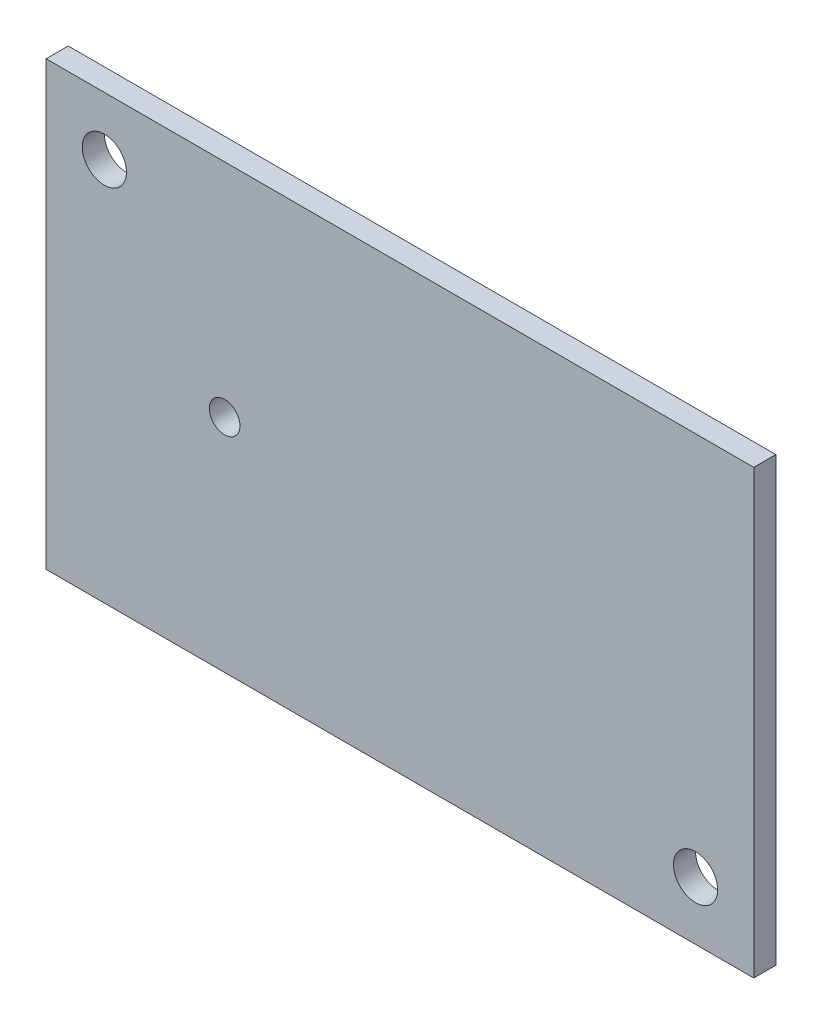
ISO-10303-21;
HEADER;
FILE_DESCRIPTION(('STEP AP214'),'2;1');
FILE_NAME('part.step','',(''),(''),'','','');
FILE_SCHEMA(('AUTOMOTIVE_DESIGN { 1 0 10303 214 1 1 1 1 }'));
ENDSEC;
DATA;
#1=APPLICATION_CONTEXT('core data for automotive mechanical design processes');
#2=APPLICATION_PROTOCOL_DEFINITION('international standard','automotive_design',2000,#1);
#3=PRODUCT_CONTEXT('',#1,'mechanical');
#4=PRODUCT('Part','Part','',(#3));
#5=PRODUCT_RELATED_PRODUCT_CATEGORY('part','',(#4));
#6=PRODUCT_DEFINITION_FORMATION('','',#4);
#7=PRODUCT_DEFINITION_CONTEXT('part definition',#1,'design');
#8=PRODUCT_DEFINITION('design','',#6,#7);
#9=PRODUCT_DEFINITION_SHAPE('','',#8);
#10=(LENGTH_UNIT() NAMED_UNIT(*) SI_UNIT(.MILLI.,.METRE.));
#11=(NAMED_UNIT(*) PLANE_ANGLE_UNIT() SI_UNIT($,.RADIAN.));
#12=(NAMED_UNIT(*) SI_UNIT($,.STERADIAN.) SOLID_ANGLE_UNIT());
#13=UNCERTAINTY_MEASURE_WITH_UNIT(LENGTH_MEASURE(1.E-05),#10,'distance_accuracy_value','');
#14=(GEOMETRIC_REPRESENTATION_CONTEXT(3) GLOBAL_UNCERTAINTY_ASSIGNED_CONTEXT((#13)) GLOBAL_UNIT_ASSIGNED_CONTEXT((#10,
#11,#12)) REPRESENTATION_CONTEXT('',''));
#15=CARTESIAN_POINT('',(0.,0.,0.));
#16=DIRECTION('',(0.,0.,1.));
#17=DIRECTION('',(1.,0.,0.));
#18=AXIS2_PLACEMENT_3D('',#15,#16,#17);
#19=CARTESIAN_POINT('',(-86.1290909090909,32.3272727272727,3.175));
#20=DIRECTION('',(1.,0.,0.));
#21=DIRECTION('',(0.,0.,-1.));
#22=AXIS2_PLACEMENT_3D('',#19,#20,#21);
#23=PLANE('',#22);
#24=DIRECTION('',(0.,-1.,0.));
#25=VECTOR('',#24,1.);
#26=CARTESIAN_POINT('',(-86.1290909090909,32.3272727272727,0.));
#27=LINE('',#26,#25);
#28=CARTESIAN_POINT('',(-86.1290909090909,32.3272727272727,0.));
#29=VERTEX_POINT('',#28);
#30=CARTESIAN_POINT('',(-86.1290909090909,-31.1727272727273,0.));
#31=VERTEX_POINT('',#30);
#32=EDGE_CURVE('E95',#29,#31,#27,.T.);
#33=ORIENTED_EDGE('',*,*,#32,.T.);
#34=DIRECTION('',(0.,0.,-1.));
#35=VECTOR('',#34,1.);
#36=CARTESIAN_POINT('',(-86.1290909090909,-31.1727272727273,3.175));
#37=LINE('',#36,#35);
#38=CARTESIAN_POINT('',(-86.1290909090909,-31.1727272727273,3.175));
#39=VERTEX_POINT('',#38);
#40=EDGE_CURVE('E11',#39,#31,#37,.T.);
#41=ORIENTED_EDGE('',*,*,#40,.F.);
#42=DIRECTION('',(0.,-1.,0.));
#43=VECTOR('',#42,1.);
#44=CARTESIAN_POINT('',(-86.1290909090909,32.3272727272727,3.175));
#45=LINE('',#44,#43);
#46=CARTESIAN_POINT('',(-86.1290909090909,32.3272727272727,3.175));
#47=VERTEX_POINT('',#46);
#48=EDGE_CURVE('E83',#47,#39,#45,.T.);
#49=ORIENTED_EDGE('',*,*,#48,.F.);
#50=DIRECTION('',(0.,0.,-1.));
#51=VECTOR('',#50,1.);
#52=CARTESIAN_POINT('',(-86.1290909090909,32.3272727272727,3.175));
#53=LINE('',#52,#51);
#54=EDGE_CURVE('E91',#47,#29,#53,.T.);
#55=ORIENTED_EDGE('',*,*,#54,.T.);
#56=EDGE_LOOP('',(#33,#41,#49,#55));
#57=FACE_BOUND('',#56,.T.);
#58=ADVANCED_FACE('F32',(#57),#23,.F.);
#59=CARTESIAN_POINT('',(-86.1290909090909,-31.1727272727273,3.175));
#60=DIRECTION('',(0.,1.,0.));
#61=DIRECTION('',(0.,0.,1.));
#62=AXIS2_PLACEMENT_3D('',#59,#60,#61);
#63=PLANE('',#62);
#64=DIRECTION('',(1.,0.,0.));
#65=VECTOR('',#64,1.);
#66=CARTESIAN_POINT('',(-86.1290909090909,-31.1727272727273,0.));
#67=LINE('',#66,#65);
#68=CARTESIAN_POINT('',(15.4709090909091,-31.1727272727273,0.));
#69=VERTEX_POINT('',#68);
#70=EDGE_CURVE('E87',#31,#69,#67,.T.);
#71=ORIENTED_EDGE('',*,*,#70,.T.);
#72=DIRECTION('',(0.,0.,-1.));
#73=VECTOR('',#72,1.);
#74=CARTESIAN_POINT('',(15.4709090909091,-31.1727272727273,3.175));
#75=LINE('',#74,#73);
#76=CARTESIAN_POINT('',(15.4709090909091,-31.1727272727273,3.175));
#77=VERTEX_POINT('',#76);
#78=EDGE_CURVE('E40',#77,#69,#75,.T.);
#79=ORIENTED_EDGE('',*,*,#78,.F.);
#80=DIRECTION('',(1.,0.,0.));
#81=VECTOR('',#80,1.);
#82=CARTESIAN_POINT('',(-86.1290909090909,-31.1727272727273,3.175));
#83=LINE('',#82,#81);
#84=EDGE_CURVE('E78',#39,#77,#83,.T.);
#85=ORIENTED_EDGE('',*,*,#84,.F.);
#86=ORIENTED_EDGE('',*,*,#40,.T.);
#87=EDGE_LOOP('',(#71,#79,#85,#86));
#88=FACE_BOUND('',#87,.T.);
#89=ADVANCED_FACE('F86',(#88),#63,.F.);
#90=CARTESIAN_POINT('',(15.4709090909091,32.3272727272727,3.175));
#91=DIRECTION('',(-1.,0.,0.));
#92=DIRECTION('',(0.,-1.,0.));
#93=AXIS2_PLACEMENT_3D('',#90,#91,#92);
#94=PLANE('',#93);
#95=DIRECTION('',(0.,1.,0.));
#96=VECTOR('',#95,1.);
#97=CARTESIAN_POINT('',(15.4709090909091,32.3272727272727,0.));
#98=LINE('',#97,#96);
#99=CARTESIAN_POINT('',(15.4709090909091,32.3272727272727,0.));
#100=VERTEX_POINT('',#99);
#101=EDGE_CURVE('E65',#69,#100,#98,.T.);
#102=ORIENTED_EDGE('',*,*,#101,.T.);
#103=DIRECTION('',(0.,0.,-1.));
#104=VECTOR('',#103,1.);
#105=CARTESIAN_POINT('',(15.4709090909091,32.3272727272727,3.175));
#106=LINE('',#105,#104);
#107=CARTESIAN_POINT('',(15.4709090909091,32.3272727272727,3.175));
#108=VERTEX_POINT('',#107);
#109=EDGE_CURVE('E88',#108,#100,#106,.T.);
#110=ORIENTED_EDGE('',*,*,#109,.F.);
#111=DIRECTION('',(0.,1.,0.));
#112=VECTOR('',#111,1.);
#113=CARTESIAN_POINT('',(15.4709090909091,32.3272727272727,3.175));
#114=LINE('',#113,#112);
#115=EDGE_CURVE('E81',#77,#108,#114,.T.);
#116=ORIENTED_EDGE('',*,*,#115,.F.);
#117=ORIENTED_EDGE('',*,*,#78,.T.);
#118=EDGE_LOOP('',(#102,#110,#116,#117));
#119=FACE_BOUND('',#118,.T.);
#120=ADVANCED_FACE('F89',(#119),#94,.F.);
#121=CARTESIAN_POINT('',(-86.1290909090909,32.3272727272727,3.175));
#122=DIRECTION('',(0.,-1.,0.));
#123=DIRECTION('',(0.,0.,-1.));
#124=AXIS2_PLACEMENT_3D('',#121,#122,#123);
#125=PLANE('',#124);
#126=DIRECTION('',(-1.,0.,0.));
#127=VECTOR('',#126,1.);
#128=CARTESIAN_POINT('',(-86.1290909090909,32.3272727272727,0.));
#129=LINE('',#128,#127);
#130=EDGE_CURVE('E71',#100,#29,#129,.T.);
#131=ORIENTED_EDGE('',*,*,#130,.T.);
#132=ORIENTED_EDGE('',*,*,#54,.F.);
#133=DIRECTION('',(-1.,0.,0.));
#134=VECTOR('',#133,1.);
#135=CARTESIAN_POINT('',(-86.1290909090909,32.3272727272727,3.175));
#136=LINE('',#135,#134);
#137=EDGE_CURVE('E48',#108,#47,#136,.T.);
#138=ORIENTED_EDGE('',*,*,#137,.F.);
#139=ORIENTED_EDGE('',*,*,#109,.T.);
#140=EDGE_LOOP('',(#131,#132,#138,#139));
#141=FACE_BOUND('',#140,.T.);
#142=ADVANCED_FACE('F103',(#141),#125,.F.);
#143=CARTESIAN_POINT('',(0.,0.,3.175));
#144=DIRECTION('',(0.,0.,1.));
#145=DIRECTION('',(1.,0.,0.));
#146=AXIS2_PLACEMENT_3D('',#143,#144,#145);
#147=PLANE('',#146);
#148=CARTESIAN_POINT('',(-60.4997970112768,0.581401186066893,3.175));
#149=DIRECTION('',(0.,0.,1.));
#150=DIRECTION('',(1.,0.,0.));
#151=AXIS2_PLACEMENT_3D('',#148,#149,#150);
#152=CIRCLE('',#151,2.19997850683864);
#153=CARTESIAN_POINT('',(-58.2998185044382,0.581401186066893,3.175));
#154=VERTEX_POINT('',#153);
#155=EDGE_CURVE('E121',#154,#154,#152,.T.);
#156=ORIENTED_EDGE('',*,*,#155,.F.);
#157=EDGE_LOOP('',(#156));
#158=FACE_BOUND('',#157,.T.);
#159=CARTESIAN_POINT('',(-77.7690909090909,23.9672727272727,3.175));
#160=DIRECTION('',(0.,0.,1.));
#161=DIRECTION('',(1.,0.,0.));
#162=AXIS2_PLACEMENT_3D('',#159,#160,#161);
#163=CIRCLE('',#162,3.175);
#164=CARTESIAN_POINT('',(-74.5940909090909,23.9672727272727,3.175));
#165=VERTEX_POINT('',#164);
#166=EDGE_CURVE('E116',#165,#165,#163,.T.);
#167=ORIENTED_EDGE('',*,*,#166,.F.);
#168=EDGE_LOOP('',(#167));
#169=FACE_BOUND('',#168,.T.);
#170=CARTESIAN_POINT('',(7.11590909090913,-22.8127272727273,3.175));
#171=DIRECTION('',(0.,0.,1.));
#172=DIRECTION('',(1.,0.,0.));
#173=AXIS2_PLACEMENT_3D('',#170,#171,#172);
#174=CIRCLE('',#173,3.175);
#175=CARTESIAN_POINT('',(10.2909090909091,-22.8127272727273,3.175));
#176=VERTEX_POINT('',#175);
#177=EDGE_CURVE('E109',#176,#176,#174,.T.);
#178=ORIENTED_EDGE('',*,*,#177,.F.);
#179=EDGE_LOOP('',(#178));
#180=FACE_BOUND('',#179,.T.);
#181=ORIENTED_EDGE('',*,*,#48,.T.);
#182=ORIENTED_EDGE('',*,*,#84,.T.);
#183=ORIENTED_EDGE('',*,*,#115,.T.);
#184=ORIENTED_EDGE('',*,*,#137,.T.);
#185=EDGE_LOOP('',(#181,#182,#183,#184));
#186=FACE_BOUND('',#185,.T.);
#187=ADVANCED_FACE('F79',(#158,#169,#180,#186),#147,.T.);
#188=CARTESIAN_POINT('',(0.,0.,0.));
#189=DIRECTION('',(0.,0.,1.));
#190=DIRECTION('',(1.,0.,0.));
#191=AXIS2_PLACEMENT_3D('',#188,#189,#190);
#192=PLANE('',#191);
#193=CARTESIAN_POINT('',(-60.4997970112768,0.581401186066893,0.));
#194=DIRECTION('',(0.,0.,1.));
#195=DIRECTION('',(1.,0.,0.));
#196=AXIS2_PLACEMENT_3D('',#193,#194,#195);
#197=CIRCLE('',#196,2.19997850683864);
#198=CARTESIAN_POINT('',(-58.2998185044382,0.581401186066893,0.));
#199=VERTEX_POINT('',#198);
#200=EDGE_CURVE('E113',#199,#199,#197,.T.);
#201=ORIENTED_EDGE('',*,*,#200,.T.);
#202=EDGE_LOOP('',(#201));
#203=FACE_BOUND('',#202,.T.);
#204=CARTESIAN_POINT('',(-77.7690909090909,23.9672727272727,0.));
#205=DIRECTION('',(0.,0.,1.));
#206=DIRECTION('',(1.,0.,0.));
#207=AXIS2_PLACEMENT_3D('',#204,#205,#206);
#208=CIRCLE('',#207,3.175);
#209=CARTESIAN_POINT('',(-74.5940909090909,23.9672727272727,0.));
#210=VERTEX_POINT('',#209);
#211=EDGE_CURVE('E98',#210,#210,#208,.T.);
#212=ORIENTED_EDGE('',*,*,#211,.T.);
#213=EDGE_LOOP('',(#212));
#214=FACE_BOUND('',#213,.T.);
#215=CARTESIAN_POINT('',(7.11590909090913,-22.8127272727273,0.));
#216=DIRECTION('',(0.,0.,1.));
#217=DIRECTION('',(1.,0.,0.));
#218=AXIS2_PLACEMENT_3D('',#215,#216,#217);
#219=CIRCLE('',#218,3.175);
#220=CARTESIAN_POINT('',(10.2909090909091,-22.8127272727273,0.));
#221=VERTEX_POINT('',#220);
#222=EDGE_CURVE('E112',#221,#221,#219,.T.);
#223=ORIENTED_EDGE('',*,*,#222,.T.);
#224=EDGE_LOOP('',(#223));
#225=FACE_BOUND('',#224,.T.);
#226=ORIENTED_EDGE('',*,*,#32,.F.);
#227=ORIENTED_EDGE('',*,*,#130,.F.);
#228=ORIENTED_EDGE('',*,*,#101,.F.);
#229=ORIENTED_EDGE('',*,*,#70,.F.);
#230=EDGE_LOOP('',(#226,#227,#228,#229));
#231=FACE_BOUND('',#230,.T.);
#232=ADVANCED_FACE('F106',(#203,#214,#225,#231),#192,.F.);
#233=CARTESIAN_POINT('',(7.11590909090913,-22.8127272727273,0.));
#234=DIRECTION('',(0.,0.,1.));
#235=DIRECTION('',(1.,0.,0.));
#236=AXIS2_PLACEMENT_3D('',#233,#234,#235);
#237=CYLINDRICAL_SURFACE('',#236,3.175);
#238=ORIENTED_EDGE('',*,*,#222,.F.);
#239=EDGE_LOOP('',(#238));
#240=FACE_BOUND('',#239,.T.);
#241=ORIENTED_EDGE('',*,*,#177,.T.);
#242=EDGE_LOOP('',(#241));
#243=FACE_BOUND('',#242,.T.);
#244=ADVANCED_FACE('F143',(#240,#243),#237,.F.);
#245=CARTESIAN_POINT('',(-77.7690909090909,23.9672727272727,0.));
#246=DIRECTION('',(0.,0.,1.));
#247=DIRECTION('',(1.,0.,0.));
#248=AXIS2_PLACEMENT_3D('',#245,#246,#247);
#249=CYLINDRICAL_SURFACE('',#248,3.175);
#250=ORIENTED_EDGE('',*,*,#211,.F.);
#251=EDGE_LOOP('',(#250));
#252=FACE_BOUND('',#251,.T.);
#253=ORIENTED_EDGE('',*,*,#166,.T.);
#254=EDGE_LOOP('',(#253));
#255=FACE_BOUND('',#254,.T.);
#256=ADVANCED_FACE('F132',(#252,#255),#249,.F.);
#257=CARTESIAN_POINT('',(-60.4997970112768,0.581401186066893,0.));
#258=DIRECTION('',(0.,0.,1.));
#259=DIRECTION('',(1.,0.,0.));
#260=AXIS2_PLACEMENT_3D('',#257,#258,#259);
#261=CYLINDRICAL_SURFACE('',#260,2.19997850683864);
#262=ORIENTED_EDGE('',*,*,#200,.F.);
#263=EDGE_LOOP('',(#262));
#264=FACE_BOUND('',#263,.T.);
#265=ORIENTED_EDGE('',*,*,#155,.T.);
#266=EDGE_LOOP('',(#265));
#267=FACE_BOUND('',#266,.T.);
#268=ADVANCED_FACE('F129',(#264,#267),#261,.F.);
#269=CLOSED_SHELL('',(#58,#89,#120,#142,#187,#232,#244,#256,#268));
#270=MANIFOLD_SOLID_BREP('B2',#269);
#271=ADVANCED_BREP_SHAPE_REPRESENTATION('',(#18,#270),#14);
#272=SHAPE_DEFINITION_REPRESENTATION(#9,#271);
ENDSEC;
END-ISO-10303-21;
